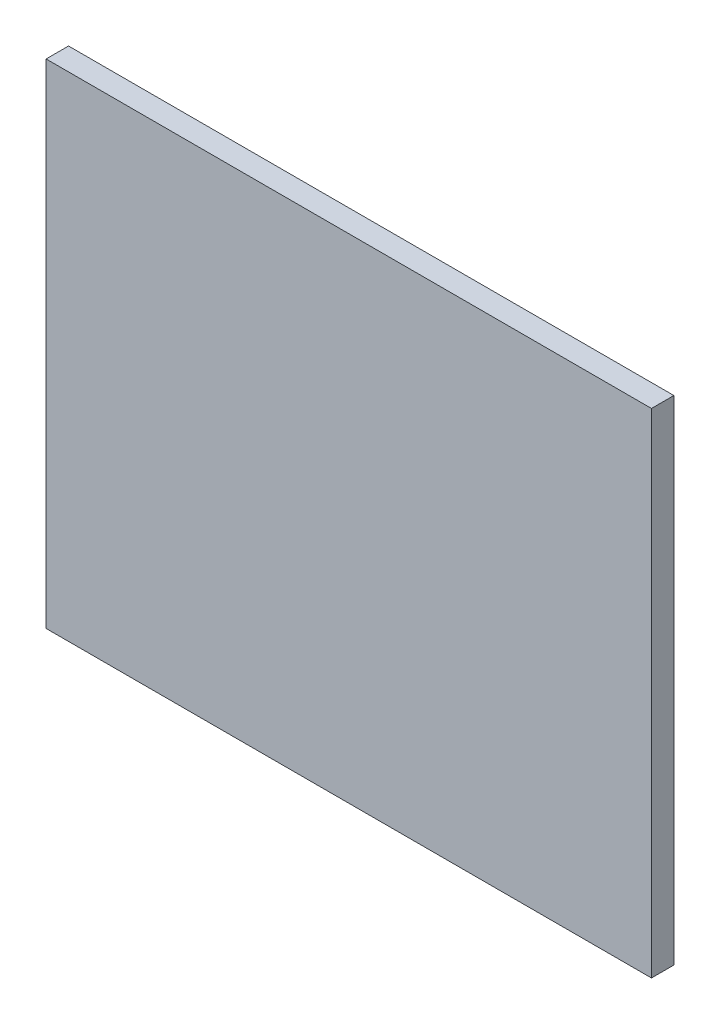
ISO-10303-21;
HEADER;
FILE_DESCRIPTION(('STEP AP214'),'2;1');
FILE_NAME('part.step','',(''),(''),'','','');
FILE_SCHEMA(('AUTOMOTIVE_DESIGN { 1 0 10303 214 1 1 1 1 }'));
ENDSEC;
DATA;
#1=APPLICATION_CONTEXT('core data for automotive mechanical design processes');
#2=APPLICATION_PROTOCOL_DEFINITION('international standard','automotive_design',2000,#1);
#3=PRODUCT_CONTEXT('',#1,'mechanical');
#4=PRODUCT('Part','Part','',(#3));
#5=PRODUCT_RELATED_PRODUCT_CATEGORY('part','',(#4));
#6=PRODUCT_DEFINITION_FORMATION('','',#4);
#7=PRODUCT_DEFINITION_CONTEXT('part definition',#1,'design');
#8=PRODUCT_DEFINITION('design','',#6,#7);
#9=PRODUCT_DEFINITION_SHAPE('','',#8);
#10=(LENGTH_UNIT() NAMED_UNIT(*) SI_UNIT(.MILLI.,.METRE.));
#11=(NAMED_UNIT(*) PLANE_ANGLE_UNIT() SI_UNIT($,.RADIAN.));
#12=(NAMED_UNIT(*) SI_UNIT($,.STERADIAN.) SOLID_ANGLE_UNIT());
#13=UNCERTAINTY_MEASURE_WITH_UNIT(LENGTH_MEASURE(1.E-05),#10,'distance_accuracy_value','');
#14=(GEOMETRIC_REPRESENTATION_CONTEXT(3) GLOBAL_UNCERTAINTY_ASSIGNED_CONTEXT((#13)) GLOBAL_UNIT_ASSIGNED_CONTEXT((#10,
#11,#12)) REPRESENTATION_CONTEXT('',''));
#15=CARTESIAN_POINT('',(0.,0.,0.));
#16=DIRECTION('',(0.,0.,1.));
#17=DIRECTION('',(1.,0.,0.));
#18=AXIS2_PLACEMENT_3D('',#15,#16,#17);
#19=CARTESIAN_POINT('',(0.,0.,1.));
#20=DIRECTION('',(-1.,0.,0.));
#21=DIRECTION('',(0.,0.,1.));
#22=AXIS2_PLACEMENT_3D('',#19,#20,#21);
#23=PLANE('',#22);
#24=DIRECTION('',(0.,1.,0.));
#25=VECTOR('',#24,1.);
#26=CARTESIAN_POINT('',(0.,0.,0.));
#27=LINE('',#26,#25);
#28=CARTESIAN_POINT('',(0.,0.,0.));
#29=VERTEX_POINT('',#28);
#30=CARTESIAN_POINT('',(0.,22.,0.));
#31=VERTEX_POINT('',#30);
#32=EDGE_CURVE('E96',#29,#31,#27,.T.);
#33=ORIENTED_EDGE('',*,*,#32,.T.);
#34=DIRECTION('',(0.,0.,-1.));
#35=VECTOR('',#34,1.);
#36=CARTESIAN_POINT('',(0.,22.,1.));
#37=LINE('',#36,#35);
#38=CARTESIAN_POINT('',(0.,22.,1.));
#39=VERTEX_POINT('',#38);
#40=EDGE_CURVE('E11',#39,#31,#37,.T.);
#41=ORIENTED_EDGE('',*,*,#40,.F.);
#42=DIRECTION('',(0.,1.,0.));
#43=VECTOR('',#42,1.);
#44=CARTESIAN_POINT('',(0.,0.,1.));
#45=LINE('',#44,#43);
#46=CARTESIAN_POINT('',(0.,0.,1.));
#47=VERTEX_POINT('',#46);
#48=EDGE_CURVE('E84',#47,#39,#45,.T.);
#49=ORIENTED_EDGE('',*,*,#48,.F.);
#50=DIRECTION('',(0.,0.,-1.));
#51=VECTOR('',#50,1.);
#52=CARTESIAN_POINT('',(0.,0.,1.));
#53=LINE('',#52,#51);
#54=EDGE_CURVE('E92',#47,#29,#53,.T.);
#55=ORIENTED_EDGE('',*,*,#54,.T.);
#56=EDGE_LOOP('',(#33,#41,#49,#55));
#57=FACE_BOUND('',#56,.T.);
#58=ADVANCED_FACE('F33',(#57),#23,.F.);
#59=CARTESIAN_POINT('',(0.,22.,1.));
#60=DIRECTION('',(0.,-1.,0.));
#61=DIRECTION('',(1.,0.,0.));
#62=AXIS2_PLACEMENT_3D('',#59,#60,#61);
#63=PLANE('',#62);
#64=DIRECTION('',(-1.,0.,0.));
#65=VECTOR('',#64,1.);
#66=CARTESIAN_POINT('',(0.,22.,0.));
#67=LINE('',#66,#65);
#68=CARTESIAN_POINT('',(-27.,22.,0.));
#69=VERTEX_POINT('',#68);
#70=EDGE_CURVE('E88',#31,#69,#67,.T.);
#71=ORIENTED_EDGE('',*,*,#70,.T.);
#72=DIRECTION('',(0.,0.,-1.));
#73=VECTOR('',#72,1.);
#74=CARTESIAN_POINT('',(-27.,22.,1.));
#75=LINE('',#74,#73);
#76=CARTESIAN_POINT('',(-27.,22.,1.));
#77=VERTEX_POINT('',#76);
#78=EDGE_CURVE('E41',#77,#69,#75,.T.);
#79=ORIENTED_EDGE('',*,*,#78,.F.);
#80=DIRECTION('',(-1.,0.,0.));
#81=VECTOR('',#80,1.);
#82=CARTESIAN_POINT('',(0.,22.,1.));
#83=LINE('',#82,#81);
#84=EDGE_CURVE('E79',#39,#77,#83,.T.);
#85=ORIENTED_EDGE('',*,*,#84,.F.);
#86=ORIENTED_EDGE('',*,*,#40,.T.);
#87=EDGE_LOOP('',(#71,#79,#85,#86));
#88=FACE_BOUND('',#87,.T.);
#89=ADVANCED_FACE('F87',(#88),#63,.F.);
#90=CARTESIAN_POINT('',(-27.,0.,1.));
#91=DIRECTION('',(1.,0.,0.));
#92=DIRECTION('',(0.,0.,-1.));
#93=AXIS2_PLACEMENT_3D('',#90,#91,#92);
#94=PLANE('',#93);
#95=DIRECTION('',(0.,-1.,0.));
#96=VECTOR('',#95,1.);
#97=CARTESIAN_POINT('',(-27.,0.,0.));
#98=LINE('',#97,#96);
#99=CARTESIAN_POINT('',(-27.,0.,0.));
#100=VERTEX_POINT('',#99);
#101=EDGE_CURVE('E66',#69,#100,#98,.T.);
#102=ORIENTED_EDGE('',*,*,#101,.T.);
#103=DIRECTION('',(0.,0.,-1.));
#104=VECTOR('',#103,1.);
#105=CARTESIAN_POINT('',(-27.,0.,1.));
#106=LINE('',#105,#104);
#107=CARTESIAN_POINT('',(-27.,0.,1.));
#108=VERTEX_POINT('',#107);
#109=EDGE_CURVE('E89',#108,#100,#106,.T.);
#110=ORIENTED_EDGE('',*,*,#109,.F.);
#111=DIRECTION('',(0.,-1.,0.));
#112=VECTOR('',#111,1.);
#113=CARTESIAN_POINT('',(-27.,0.,1.));
#114=LINE('',#113,#112);
#115=EDGE_CURVE('E82',#77,#108,#114,.T.);
#116=ORIENTED_EDGE('',*,*,#115,.F.);
#117=ORIENTED_EDGE('',*,*,#78,.T.);
#118=EDGE_LOOP('',(#102,#110,#116,#117));
#119=FACE_BOUND('',#118,.T.);
#120=ADVANCED_FACE('F90',(#119),#94,.F.);
#121=CARTESIAN_POINT('',(0.,0.,1.));
#122=DIRECTION('',(0.,1.,0.));
#123=DIRECTION('',(-1.,0.,0.));
#124=AXIS2_PLACEMENT_3D('',#121,#122,#123);
#125=PLANE('',#124);
#126=DIRECTION('',(1.,0.,0.));
#127=VECTOR('',#126,1.);
#128=CARTESIAN_POINT('',(0.,0.,0.));
#129=LINE('',#128,#127);
#130=EDGE_CURVE('E72',#100,#29,#129,.T.);
#131=ORIENTED_EDGE('',*,*,#130,.T.);
#132=ORIENTED_EDGE('',*,*,#54,.F.);
#133=DIRECTION('',(1.,0.,0.));
#134=VECTOR('',#133,1.);
#135=CARTESIAN_POINT('',(0.,0.,1.));
#136=LINE('',#135,#134);
#137=EDGE_CURVE('E49',#108,#47,#136,.T.);
#138=ORIENTED_EDGE('',*,*,#137,.F.);
#139=ORIENTED_EDGE('',*,*,#109,.T.);
#140=EDGE_LOOP('',(#131,#132,#138,#139));
#141=FACE_BOUND('',#140,.T.);
#142=ADVANCED_FACE('F103',(#141),#125,.F.);
#143=CARTESIAN_POINT('',(0.,0.,1.));
#144=DIRECTION('',(0.,0.,1.));
#145=DIRECTION('',(1.,0.,0.));
#146=AXIS2_PLACEMENT_3D('',#143,#144,#145);
#147=PLANE('',#146);
#148=ORIENTED_EDGE('',*,*,#48,.T.);
#149=ORIENTED_EDGE('',*,*,#84,.T.);
#150=ORIENTED_EDGE('',*,*,#115,.T.);
#151=ORIENTED_EDGE('',*,*,#137,.T.);
#152=EDGE_LOOP('',(#148,#149,#150,#151));
#153=FACE_BOUND('',#152,.T.);
#154=ADVANCED_FACE('F80',(#153),#147,.T.);
#155=CARTESIAN_POINT('',(0.,0.,0.));
#156=DIRECTION('',(0.,0.,1.));
#157=DIRECTION('',(1.,0.,0.));
#158=AXIS2_PLACEMENT_3D('',#155,#156,#157);
#159=PLANE('',#158);
#160=ORIENTED_EDGE('',*,*,#32,.F.);
#161=ORIENTED_EDGE('',*,*,#130,.F.);
#162=ORIENTED_EDGE('',*,*,#101,.F.);
#163=ORIENTED_EDGE('',*,*,#70,.F.);
#164=EDGE_LOOP('',(#160,#161,#162,#163));
#165=FACE_BOUND('',#164,.T.);
#166=ADVANCED_FACE('F106',(#165),#159,.F.);
#167=CLOSED_SHELL('',(#58,#89,#120,#142,#154,#166));
#168=MANIFOLD_SOLID_BREP('B2',#167);
#169=ADVANCED_BREP_SHAPE_REPRESENTATION('',(#18,#168),#14);
#170=SHAPE_DEFINITION_REPRESENTATION(#9,#169);
ENDSEC;
END-ISO-10303-21;
